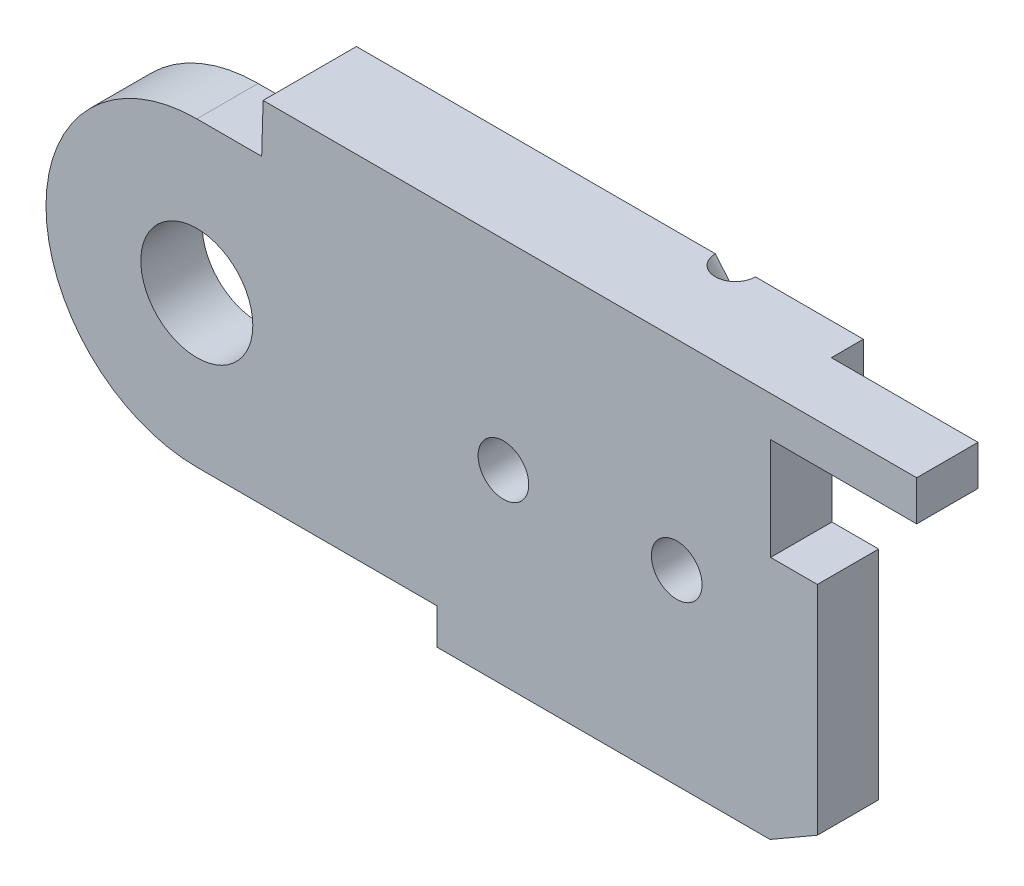
ISO-10303-21;
HEADER;
FILE_DESCRIPTION(('STEP AP214'),'2;1');
FILE_NAME('part.step','',(''),(''),'','','');
FILE_SCHEMA(('AUTOMOTIVE_DESIGN { 1 0 10303 214 1 1 1 1 }'));
ENDSEC;
DATA;
#1=APPLICATION_CONTEXT('core data for automotive mechanical design processes');
#2=APPLICATION_PROTOCOL_DEFINITION('international standard','automotive_design',2000,#1);
#3=PRODUCT_CONTEXT('',#1,'mechanical');
#4=PRODUCT('Part','Part','',(#3));
#5=PRODUCT_RELATED_PRODUCT_CATEGORY('part','',(#4));
#6=PRODUCT_DEFINITION_FORMATION('','',#4);
#7=PRODUCT_DEFINITION_CONTEXT('part definition',#1,'design');
#8=PRODUCT_DEFINITION('design','',#6,#7);
#9=PRODUCT_DEFINITION_SHAPE('','',#8);
#10=(LENGTH_UNIT() NAMED_UNIT(*) SI_UNIT(.MILLI.,.METRE.));
#11=(NAMED_UNIT(*) PLANE_ANGLE_UNIT() SI_UNIT($,.RADIAN.));
#12=(NAMED_UNIT(*) SI_UNIT($,.STERADIAN.) SOLID_ANGLE_UNIT());
#13=UNCERTAINTY_MEASURE_WITH_UNIT(LENGTH_MEASURE(1.E-05),#10,'distance_accuracy_value','');
#14=(GEOMETRIC_REPRESENTATION_CONTEXT(3) GLOBAL_UNCERTAINTY_ASSIGNED_CONTEXT((#13)) GLOBAL_UNIT_ASSIGNED_CONTEXT((#10,
#11,#12)) REPRESENTATION_CONTEXT('',''));
#15=CARTESIAN_POINT('',(0.,0.,0.));
#16=DIRECTION('',(0.,0.,1.));
#17=DIRECTION('',(1.,0.,0.));
#18=AXIS2_PLACEMENT_3D('',#15,#16,#17);
#19=CARTESIAN_POINT('',(0.,0.,11.5));
#20=DIRECTION('',(0.,0.,-1.));
#21=DIRECTION('',(1.,0.,0.));
#22=AXIS2_PLACEMENT_3D('',#19,#20,#21);
#23=CYLINDRICAL_SURFACE('',#22,2.1);
#24=CARTESIAN_POINT('',(0.,0.,11.5));
#25=DIRECTION('',(0.,0.,1.));
#26=DIRECTION('',(1.,0.,0.));
#27=AXIS2_PLACEMENT_3D('',#24,#25,#26);
#28=CIRCLE('',#27,2.1);
#29=CARTESIAN_POINT('',(2.1,0.,11.5));
#30=VERTEX_POINT('',#29);
#31=EDGE_CURVE('E230',#30,#30,#28,.T.);
#32=ORIENTED_EDGE('',*,*,#31,.T.);
#33=EDGE_LOOP('',(#32));
#34=FACE_BOUND('',#33,.T.);
#35=CARTESIAN_POINT('',(0.,0.,9.2));
#36=DIRECTION('',(0.,0.,1.));
#37=DIRECTION('',(1.,0.,0.));
#38=AXIS2_PLACEMENT_3D('',#35,#36,#37);
#39=CIRCLE('',#38,2.1);
#40=CARTESIAN_POINT('',(2.1,0.,9.2));
#41=VERTEX_POINT('',#40);
#42=EDGE_CURVE('E229',#41,#41,#39,.T.);
#43=ORIENTED_EDGE('',*,*,#42,.F.);
#44=EDGE_LOOP('',(#43));
#45=FACE_BOUND('',#44,.T.);
#46=ADVANCED_FACE('F42',(#34,#45),#23,.F.);
#47=CARTESIAN_POINT('',(21.5203540034992,2.1720062451962,11.6));
#48=DIRECTION('',(-1.,0.,0.));
#49=DIRECTION('',(0.,0.,-1.));
#50=AXIS2_PLACEMENT_3D('',#47,#48,#49);
#51=PLANE('',#50);
#52=DIRECTION('',(0.,0.,-1.));
#53=VECTOR('',#52,1.);
#54=CARTESIAN_POINT('',(21.5203540034992,6.,11.6));
#55=LINE('',#54,#53);
#56=CARTESIAN_POINT('',(21.5203540034992,6.,11.5));
#57=VERTEX_POINT('',#56);
#58=CARTESIAN_POINT('',(21.5203540034992,6.,9.2));
#59=VERTEX_POINT('',#58);
#60=EDGE_CURVE('E65',#57,#59,#55,.T.);
#61=ORIENTED_EDGE('',*,*,#60,.F.);
#62=DIRECTION('',(0.,-1.,0.));
#63=VECTOR('',#62,1.);
#64=CARTESIAN_POINT('',(21.5203540034992,0.,11.5));
#65=LINE('',#64,#63);
#66=CARTESIAN_POINT('',(21.5203540034992,2.1720062451962,11.5));
#67=VERTEX_POINT('',#66);
#68=EDGE_CURVE('E346',#57,#67,#65,.T.);
#69=ORIENTED_EDGE('',*,*,#68,.T.);
#70=DIRECTION('',(0.,0.,-1.));
#71=VECTOR('',#70,1.);
#72=CARTESIAN_POINT('',(21.5203540034992,2.1720062451962,11.6));
#73=LINE('',#72,#71);
#74=CARTESIAN_POINT('',(21.5203540034992,2.1720062451962,9.2));
#75=VERTEX_POINT('',#74);
#76=EDGE_CURVE('E388',#67,#75,#73,.T.);
#77=ORIENTED_EDGE('',*,*,#76,.T.);
#78=DIRECTION('',(0.,-1.,0.));
#79=VECTOR('',#78,1.);
#80=CARTESIAN_POINT('',(21.5203540034992,2.1720062451962,9.2));
#81=LINE('',#80,#79);
#82=EDGE_CURVE('E404',#59,#75,#81,.T.);
#83=ORIENTED_EDGE('',*,*,#82,.F.);
#84=EDGE_LOOP('',(#61,#69,#77,#83));
#85=FACE_BOUND('',#84,.T.);
#86=ADVANCED_FACE('F508',(#85),#51,.F.);
#87=CARTESIAN_POINT('',(27.,6.,11.6));
#88=DIRECTION('',(0.,1.,0.));
#89=DIRECTION('',(0.,0.,-1.));
#90=AXIS2_PLACEMENT_3D('',#87,#88,#89);
#91=PLANE('',#90);
#92=DIRECTION('',(0.,0.,-1.));
#93=VECTOR('',#92,1.);
#94=CARTESIAN_POINT('',(27.,6.,11.6));
#95=LINE('',#94,#93);
#96=CARTESIAN_POINT('',(27.,6.,11.5));
#97=VERTEX_POINT('',#96);
#98=CARTESIAN_POINT('',(27.,6.,9.2));
#99=VERTEX_POINT('',#98);
#100=EDGE_CURVE('E401',#97,#99,#95,.T.);
#101=ORIENTED_EDGE('',*,*,#100,.F.);
#102=DIRECTION('',(-1.,0.,0.));
#103=VECTOR('',#102,1.);
#104=CARTESIAN_POINT('',(0.,6.,11.5));
#105=LINE('',#104,#103);
#106=EDGE_CURVE('E343',#97,#57,#105,.T.);
#107=ORIENTED_EDGE('',*,*,#106,.T.);
#108=ORIENTED_EDGE('',*,*,#60,.T.);
#109=DIRECTION('',(-1.,0.,0.));
#110=VECTOR('',#109,1.);
#111=CARTESIAN_POINT('',(27.,6.,9.2));
#112=LINE('',#111,#110);
#113=EDGE_CURVE('E412',#99,#59,#112,.T.);
#114=ORIENTED_EDGE('',*,*,#113,.F.);
#115=EDGE_LOOP('',(#101,#107,#108,#114));
#116=FACE_BOUND('',#115,.T.);
#117=ADVANCED_FACE('F514',(#116),#91,.F.);
#118=CARTESIAN_POINT('',(0.,0.,9.2));
#119=DIRECTION('',(0.,0.,1.));
#120=DIRECTION('',(-1.,0.,0.));
#121=AXIS2_PLACEMENT_3D('',#118,#119,#120);
#122=CYLINDRICAL_SURFACE('',#121,5.65685424949238);
#123=CARTESIAN_POINT('',(0.,0.,11.5));
#124=DIRECTION('',(0.,0.,1.));
#125=DIRECTION('',(1.,0.,0.));
#126=AXIS2_PLACEMENT_3D('',#123,#124,#125);
#127=CIRCLE('',#126,5.65685424949238);
#128=CARTESIAN_POINT('',(0.,5.65685424949238,11.5));
#129=VERTEX_POINT('',#128);
#130=CARTESIAN_POINT('',(0.,-5.65685424949238,11.5));
#131=VERTEX_POINT('',#130);
#132=EDGE_CURVE('E234',#129,#131,#127,.T.);
#133=ORIENTED_EDGE('',*,*,#132,.F.);
#134=DIRECTION('',(0.,0.,1.));
#135=VECTOR('',#134,1.);
#136=CARTESIAN_POINT('',(0.,5.65685424949238,9.2));
#137=LINE('',#136,#135);
#138=CARTESIAN_POINT('',(0.,5.65685424949238,9.2));
#139=VERTEX_POINT('',#138);
#140=EDGE_CURVE('E267',#139,#129,#137,.T.);
#141=ORIENTED_EDGE('',*,*,#140,.F.);
#142=CARTESIAN_POINT('',(0.,0.,9.2));
#143=DIRECTION('',(0.,0.,1.));
#144=DIRECTION('',(1.,0.,0.));
#145=AXIS2_PLACEMENT_3D('',#142,#143,#144);
#146=CIRCLE('',#145,5.65685424949238);
#147=CARTESIAN_POINT('',(0.,-5.65685424949238,9.2));
#148=VERTEX_POINT('',#147);
#149=EDGE_CURVE('E238',#139,#148,#146,.T.);
#150=ORIENTED_EDGE('',*,*,#149,.T.);
#151=DIRECTION('',(0.,0.,1.));
#152=VECTOR('',#151,1.);
#153=CARTESIAN_POINT('',(0.,-5.65685424949238,9.2));
#154=LINE('',#153,#152);
#155=EDGE_CURVE('E339',#148,#131,#154,.T.);
#156=ORIENTED_EDGE('',*,*,#155,.T.);
#157=EDGE_LOOP('',(#133,#141,#150,#156));
#158=FACE_BOUND('',#157,.T.);
#159=ADVANCED_FACE('F44',(#158),#122,.T.);
#160=CARTESIAN_POINT('',(23.2751262658471,-5.97487373415292,9.2));
#161=DIRECTION('',(-1.,0.,0.));
#162=DIRECTION('',(0.,0.,-1.));
#163=AXIS2_PLACEMENT_3D('',#160,#161,#162);
#164=PLANE('',#163);
#165=DIRECTION('',(0.,1.,0.));
#166=VECTOR('',#165,1.);
#167=CARTESIAN_POINT('',(23.2751262658471,-5.97487373415292,11.5));
#168=LINE('',#167,#166);
#169=CARTESIAN_POINT('',(23.2751262658471,-5.97487373415292,11.5));
#170=VERTEX_POINT('',#169);
#171=CARTESIAN_POINT('',(23.2751262658471,2.1720062451962,11.5));
#172=VERTEX_POINT('',#171);
#173=EDGE_CURVE('E287',#170,#172,#168,.T.);
#174=ORIENTED_EDGE('',*,*,#173,.F.);
#175=DIRECTION('',(0.,0.,1.));
#176=VECTOR('',#175,1.);
#177=CARTESIAN_POINT('',(23.2751262658471,-5.97487373415292,9.2));
#178=LINE('',#177,#176);
#179=CARTESIAN_POINT('',(23.2751262658471,-5.97487373415292,9.2));
#180=VERTEX_POINT('',#179);
#181=EDGE_CURVE('E323',#180,#170,#178,.T.);
#182=ORIENTED_EDGE('',*,*,#181,.F.);
#183=DIRECTION('',(0.,1.,0.));
#184=VECTOR('',#183,1.);
#185=CARTESIAN_POINT('',(23.2751262658471,-5.97487373415292,9.2));
#186=LINE('',#185,#184);
#187=CARTESIAN_POINT('',(23.2751262658471,2.1720062451962,9.2));
#188=VERTEX_POINT('',#187);
#189=EDGE_CURVE('E251',#180,#188,#186,.T.);
#190=ORIENTED_EDGE('',*,*,#189,.T.);
#191=DIRECTION('',(0.,0.,1.));
#192=VECTOR('',#191,1.);
#193=CARTESIAN_POINT('',(23.2751262658471,2.1720062451962,9.2));
#194=LINE('',#193,#192);
#195=EDGE_CURVE('E319',#188,#172,#194,.T.);
#196=ORIENTED_EDGE('',*,*,#195,.T.);
#197=EDGE_LOOP('',(#174,#182,#190,#196));
#198=FACE_BOUND('',#197,.T.);
#199=ADVANCED_FACE('F471',(#198),#164,.F.);
#200=CARTESIAN_POINT('',(27.,2.1720062451962,11.6));
#201=DIRECTION('',(0.,-1.,0.));
#202=DIRECTION('',(0.,0.,1.));
#203=AXIS2_PLACEMENT_3D('',#200,#201,#202);
#204=PLANE('',#203);
#205=DIRECTION('',(1.,0.,0.));
#206=VECTOR('',#205,1.);
#207=CARTESIAN_POINT('',(0.,2.1720062451962,11.5));
#208=LINE('',#207,#206);
#209=EDGE_CURVE('E349',#67,#172,#208,.T.);
#210=ORIENTED_EDGE('',*,*,#209,.T.);
#211=ORIENTED_EDGE('',*,*,#195,.F.);
#212=DIRECTION('',(1.,0.,0.));
#213=VECTOR('',#212,1.);
#214=CARTESIAN_POINT('',(27.,2.1720062451962,9.2));
#215=LINE('',#214,#213);
#216=EDGE_CURVE('E416',#75,#188,#215,.T.);
#217=ORIENTED_EDGE('',*,*,#216,.F.);
#218=ORIENTED_EDGE('',*,*,#76,.F.);
#219=EDGE_LOOP('',(#210,#211,#217,#218));
#220=FACE_BOUND('',#219,.T.);
#221=ADVANCED_FACE('F474',(#220),#204,.F.);
#222=CARTESIAN_POINT('',(21.5,-6.99999999999999,9.2));
#223=DIRECTION('',(-0.500093895229063,0.865971186561437,0.));
#224=DIRECTION('',(-0.865971186561437,-0.500093895229063,0.));
#225=AXIS2_PLACEMENT_3D('',#222,#223,#224);
#226=PLANE('',#225);
#227=DIRECTION('',(0.865971186561437,0.500093895229063,0.));
#228=VECTOR('',#227,1.);
#229=CARTESIAN_POINT('',(21.5,-6.99999999999999,11.5));
#230=LINE('',#229,#228);
#231=CARTESIAN_POINT('',(21.5,-6.99999999999999,11.5));
#232=VERTEX_POINT('',#231);
#233=EDGE_CURVE('E283',#232,#170,#230,.T.);
#234=ORIENTED_EDGE('',*,*,#233,.F.);
#235=DIRECTION('',(0.,0.,1.));
#236=VECTOR('',#235,1.);
#237=CARTESIAN_POINT('',(21.5,-6.99999999999999,9.2));
#238=LINE('',#237,#236);
#239=CARTESIAN_POINT('',(21.5,-6.99999999999999,9.2));
#240=VERTEX_POINT('',#239);
#241=EDGE_CURVE('E327',#240,#232,#238,.T.);
#242=ORIENTED_EDGE('',*,*,#241,.F.);
#243=DIRECTION('',(0.865971186561437,0.500093895229063,0.));
#244=VECTOR('',#243,1.);
#245=CARTESIAN_POINT('',(21.5,-6.99999999999999,9.2));
#246=LINE('',#245,#244);
#247=EDGE_CURVE('E247',#240,#180,#246,.T.);
#248=ORIENTED_EDGE('',*,*,#247,.T.);
#249=ORIENTED_EDGE('',*,*,#181,.T.);
#250=EDGE_LOOP('',(#234,#242,#248,#249));
#251=FACE_BOUND('',#250,.T.);
#252=ADVANCED_FACE('F476',(#251),#226,.F.);
#253=CARTESIAN_POINT('',(21.5,-6.99999999999999,8.));
#254=DIRECTION('',(-1.,0.,0.));
#255=DIRECTION('',(0.,0.,-1.));
#256=AXIS2_PLACEMENT_3D('',#253,#254,#255);
#257=PLANE('',#256);
#258=DIRECTION('',(0.,1.,0.));
#259=VECTOR('',#258,1.);
#260=CARTESIAN_POINT('',(21.5,-6.99999999999999,9.2));
#261=LINE('',#260,#259);
#262=CARTESIAN_POINT('',(21.5,-5.65685424949238,9.2));
#263=VERTEX_POINT('',#262);
#264=EDGE_CURVE('E379',#240,#263,#261,.T.);
#265=ORIENTED_EDGE('',*,*,#264,.F.);
#266=DIRECTION('',(0.,0.,1.));
#267=VECTOR('',#266,1.);
#268=CARTESIAN_POINT('',(21.5,-6.99999999999999,8.));
#269=LINE('',#268,#267);
#270=CARTESIAN_POINT('',(21.5,-6.99999999999999,8.));
#271=VERTEX_POINT('',#270);
#272=EDGE_CURVE('E371',#271,#240,#269,.T.);
#273=ORIENTED_EDGE('',*,*,#272,.F.);
#274=DIRECTION('',(0.,1.,0.));
#275=VECTOR('',#274,1.);
#276=CARTESIAN_POINT('',(21.5,-6.99999999999999,8.));
#277=LINE('',#276,#275);
#278=CARTESIAN_POINT('',(21.5,-5.65685424949238,8.));
#279=VERTEX_POINT('',#278);
#280=EDGE_CURVE('E378',#271,#279,#277,.T.);
#281=ORIENTED_EDGE('',*,*,#280,.T.);
#282=DIRECTION('',(0.,0.,1.));
#283=VECTOR('',#282,1.);
#284=CARTESIAN_POINT('',(21.5,-5.65685424949238,8.));
#285=LINE('',#284,#283);
#286=EDGE_CURVE('E375',#279,#263,#285,.T.);
#287=ORIENTED_EDGE('',*,*,#286,.T.);
#288=EDGE_LOOP('',(#265,#273,#281,#287));
#289=FACE_BOUND('',#288,.T.);
#290=ADVANCED_FACE('F479',(#289),#257,.F.);
#291=CARTESIAN_POINT('',(9.,-6.99999999999999,9.2));
#292=DIRECTION('',(0.,1.,0.));
#293=DIRECTION('',(-1.,0.,0.));
#294=AXIS2_PLACEMENT_3D('',#291,#292,#293);
#295=PLANE('',#294);
#296=DIRECTION('',(1.,0.,0.));
#297=VECTOR('',#296,1.);
#298=CARTESIAN_POINT('',(9.,-6.99999999999999,11.5));
#299=LINE('',#298,#297);
#300=CARTESIAN_POINT('',(9.,-6.99999999999999,11.5));
#301=VERTEX_POINT('',#300);
#302=EDGE_CURVE('E279',#301,#232,#299,.T.);
#303=ORIENTED_EDGE('',*,*,#302,.F.);
#304=DIRECTION('',(0.,0.,1.));
#305=VECTOR('',#304,1.);
#306=CARTESIAN_POINT('',(9.,-6.99999999999999,9.2));
#307=LINE('',#306,#305);
#308=CARTESIAN_POINT('',(9.,-6.99999999999999,8.));
#309=VERTEX_POINT('',#308);
#310=EDGE_CURVE('E331',#309,#301,#307,.T.);
#311=ORIENTED_EDGE('',*,*,#310,.F.);
#312=DIRECTION('',(1.,0.,0.));
#313=VECTOR('',#312,1.);
#314=CARTESIAN_POINT('',(9.,-6.99999999999999,8.));
#315=LINE('',#314,#313);
#316=EDGE_CURVE('E391',#309,#271,#315,.T.);
#317=ORIENTED_EDGE('',*,*,#316,.T.);
#318=ORIENTED_EDGE('',*,*,#272,.T.);
#319=ORIENTED_EDGE('',*,*,#241,.T.);
#320=EDGE_LOOP('',(#303,#311,#317,#318,#319));
#321=FACE_BOUND('',#320,.T.);
#322=ADVANCED_FACE('F481',(#321),#295,.F.);
#323=CARTESIAN_POINT('',(21.5,-5.65685424949238,8.));
#324=DIRECTION('',(0.,-1.,0.));
#325=DIRECTION('',(0.,0.,1.));
#326=AXIS2_PLACEMENT_3D('',#323,#324,#325);
#327=PLANE('',#326);
#328=DIRECTION('',(-1.,0.,0.));
#329=VECTOR('',#328,1.);
#330=CARTESIAN_POINT('',(21.5,-5.65685424949238,9.2));
#331=LINE('',#330,#329);
#332=CARTESIAN_POINT('',(9.,-5.65685424949238,9.2));
#333=VERTEX_POINT('',#332);
#334=EDGE_CURVE('E384',#263,#333,#331,.T.);
#335=ORIENTED_EDGE('',*,*,#334,.F.);
#336=ORIENTED_EDGE('',*,*,#286,.F.);
#337=DIRECTION('',(-1.,0.,0.));
#338=VECTOR('',#337,1.);
#339=CARTESIAN_POINT('',(21.5,-5.65685424949238,8.));
#340=LINE('',#339,#338);
#341=CARTESIAN_POINT('',(9.,-5.65685424949238,8.));
#342=VERTEX_POINT('',#341);
#343=EDGE_CURVE('E383',#279,#342,#340,.T.);
#344=ORIENTED_EDGE('',*,*,#343,.T.);
#345=DIRECTION('',(0.,0.,1.));
#346=VECTOR('',#345,1.);
#347=CARTESIAN_POINT('',(9.,-5.65685424949238,8.));
#348=LINE('',#347,#346);
#349=EDGE_CURVE('E218',#342,#333,#348,.T.);
#350=ORIENTED_EDGE('',*,*,#349,.T.);
#351=EDGE_LOOP('',(#335,#336,#344,#350));
#352=FACE_BOUND('',#351,.T.);
#353=ADVANCED_FACE('F484',(#352),#327,.F.);
#354=CARTESIAN_POINT('',(9.,-5.65685424949238,9.2));
#355=DIRECTION('',(0.,1.,0.));
#356=DIRECTION('',(0.,0.,-1.));
#357=AXIS2_PLACEMENT_3D('',#354,#355,#356);
#358=PLANE('',#357);
#359=DIRECTION('',(1.,0.,0.));
#360=VECTOR('',#359,1.);
#361=CARTESIAN_POINT('',(9.,-5.65685424949238,11.5));
#362=LINE('',#361,#360);
#363=CARTESIAN_POINT('',(9.,-5.65685424949238,11.5));
#364=VERTEX_POINT('',#363);
#365=EDGE_CURVE('E271',#131,#364,#362,.T.);
#366=ORIENTED_EDGE('',*,*,#365,.F.);
#367=ORIENTED_EDGE('',*,*,#155,.F.);
#368=DIRECTION('',(1.,0.,0.));
#369=VECTOR('',#368,1.);
#370=CARTESIAN_POINT('',(9.,-5.65685424949238,9.2));
#371=LINE('',#370,#369);
#372=EDGE_CURVE('E242',#148,#333,#371,.T.);
#373=ORIENTED_EDGE('',*,*,#372,.T.);
#374=DIRECTION('',(0.,0.,1.));
#375=VECTOR('',#374,1.);
#376=CARTESIAN_POINT('',(9.,-5.65685424949238,9.2));
#377=LINE('',#376,#375);
#378=EDGE_CURVE('E335',#333,#364,#377,.T.);
#379=ORIENTED_EDGE('',*,*,#378,.T.);
#380=EDGE_LOOP('',(#366,#367,#373,#379));
#381=FACE_BOUND('',#380,.T.);
#382=ADVANCED_FACE('F490',(#381),#358,.F.);
#383=CARTESIAN_POINT('',(2.4326880657739,5.65685424949238,9.2));
#384=DIRECTION('',(0.,-1.,0.));
#385=DIRECTION('',(0.,0.,1.));
#386=AXIS2_PLACEMENT_3D('',#383,#384,#385);
#387=PLANE('',#386);
#388=DIRECTION('',(-1.,0.,0.));
#389=VECTOR('',#388,1.);
#390=CARTESIAN_POINT('',(2.4326880657739,5.65685424949238,11.5));
#391=LINE('',#390,#389);
#392=CARTESIAN_POINT('',(2.4326880657739,5.65685424949238,11.5));
#393=VERTEX_POINT('',#392);
#394=EDGE_CURVE('E243',#393,#129,#391,.T.);
#395=ORIENTED_EDGE('',*,*,#394,.F.);
#396=DIRECTION('',(0.,0.,1.));
#397=VECTOR('',#396,1.);
#398=CARTESIAN_POINT('',(2.4326880657739,5.65685424949238,9.2));
#399=LINE('',#398,#397);
#400=CARTESIAN_POINT('',(2.4326880657739,5.65685424949238,9.2));
#401=VERTEX_POINT('',#400);
#402=EDGE_CURVE('E308',#401,#393,#399,.T.);
#403=ORIENTED_EDGE('',*,*,#402,.F.);
#404=DIRECTION('',(-1.,0.,0.));
#405=VECTOR('',#404,1.);
#406=CARTESIAN_POINT('',(2.4326880657739,5.65685424949238,9.2));
#407=LINE('',#406,#405);
#408=EDGE_CURVE('E263',#401,#139,#407,.T.);
#409=ORIENTED_EDGE('',*,*,#408,.T.);
#410=ORIENTED_EDGE('',*,*,#140,.T.);
#411=EDGE_LOOP('',(#395,#403,#409,#410));
#412=FACE_BOUND('',#411,.T.);
#413=ADVANCED_FACE('F469',(#412),#387,.F.);
#414=CARTESIAN_POINT('',(27.,7.5,9.2));
#415=DIRECTION('',(-1.,0.,0.));
#416=DIRECTION('',(0.,0.,-1.));
#417=AXIS2_PLACEMENT_3D('',#414,#415,#416);
#418=PLANE('',#417);
#419=DIRECTION('',(0.,1.,0.));
#420=VECTOR('',#419,1.);
#421=CARTESIAN_POINT('',(27.,7.5,9.2));
#422=LINE('',#421,#420);
#423=CARTESIAN_POINT('',(27.,7.5,9.2));
#424=VERTEX_POINT('',#423);
#425=EDGE_CURVE('E255',#99,#424,#422,.T.);
#426=ORIENTED_EDGE('',*,*,#425,.T.);
#427=DIRECTION('',(0.,0.,1.));
#428=VECTOR('',#427,1.);
#429=CARTESIAN_POINT('',(27.,7.5,9.2));
#430=LINE('',#429,#428);
#431=CARTESIAN_POINT('',(27.,7.5,11.5));
#432=VERTEX_POINT('',#431);
#433=EDGE_CURVE('E315',#424,#432,#430,.T.);
#434=ORIENTED_EDGE('',*,*,#433,.T.);
#435=DIRECTION('',(0.,1.,0.));
#436=VECTOR('',#435,1.);
#437=CARTESIAN_POINT('',(27.,7.5,11.5));
#438=LINE('',#437,#436);
#439=EDGE_CURVE('E291',#97,#432,#438,.T.);
#440=ORIENTED_EDGE('',*,*,#439,.F.);
#441=ORIENTED_EDGE('',*,*,#100,.T.);
#442=EDGE_LOOP('',(#426,#434,#440,#441));
#443=FACE_BOUND('',#442,.T.);
#444=ADVANCED_FACE('F465',(#443),#418,.F.);
#445=CARTESIAN_POINT('',(0.,0.,11.5));
#446=DIRECTION('',(0.,0.,-1.));
#447=DIRECTION('',(1.,0.,0.));
#448=AXIS2_PLACEMENT_3D('',#445,#446,#447);
#449=PLANE('',#448);
#450=CARTESIAN_POINT('',(11.5,0.,11.5));
#451=DIRECTION('',(0.,0.,1.));
#452=DIRECTION('',(1.,0.,0.));
#453=AXIS2_PLACEMENT_3D('',#450,#451,#452);
#454=CIRCLE('',#453,0.949999999999999);
#455=CARTESIAN_POINT('',(12.45,0.,11.5));
#456=VERTEX_POINT('',#455);
#457=EDGE_CURVE('E433',#456,#456,#454,.T.);
#458=ORIENTED_EDGE('',*,*,#457,.F.);
#459=EDGE_LOOP('',(#458));
#460=FACE_BOUND('',#459,.T.);
#461=CARTESIAN_POINT('',(18.,0.,11.5));
#462=DIRECTION('',(0.,0.,1.));
#463=DIRECTION('',(1.,0.,0.));
#464=AXIS2_PLACEMENT_3D('',#461,#462,#463);
#465=CIRCLE('',#464,0.950000000000001);
#466=CARTESIAN_POINT('',(18.95,0.,11.5));
#467=VERTEX_POINT('',#466);
#468=EDGE_CURVE('E440',#467,#467,#465,.T.);
#469=ORIENTED_EDGE('',*,*,#468,.F.);
#470=EDGE_LOOP('',(#469));
#471=FACE_BOUND('',#470,.T.);
#472=ORIENTED_EDGE('',*,*,#31,.F.);
#473=EDGE_LOOP('',(#472));
#474=FACE_BOUND('',#473,.T.);
#475=ORIENTED_EDGE('',*,*,#68,.F.);
#476=ORIENTED_EDGE('',*,*,#106,.F.);
#477=ORIENTED_EDGE('',*,*,#439,.T.);
#478=DIRECTION('',(-1.,0.,0.));
#479=VECTOR('',#478,1.);
#480=CARTESIAN_POINT('',(27.,7.5,11.5));
#481=LINE('',#480,#479);
#482=CARTESIAN_POINT('',(2.48679014755027,7.5,11.5));
#483=VERTEX_POINT('',#482);
#484=EDGE_CURVE('E295',#432,#483,#481,.T.);
#485=ORIENTED_EDGE('',*,*,#484,.T.);
#486=DIRECTION('',(-0.0293404845923219,-0.999569475306188,0.));
#487=VECTOR('',#486,1.);
#488=CARTESIAN_POINT('',(2.4326880657739,5.65685424949238,11.5));
#489=LINE('',#488,#487);
#490=EDGE_CURVE('E299',#483,#393,#489,.T.);
#491=ORIENTED_EDGE('',*,*,#490,.T.);
#492=ORIENTED_EDGE('',*,*,#394,.T.);
#493=ORIENTED_EDGE('',*,*,#132,.T.);
#494=ORIENTED_EDGE('',*,*,#365,.T.);
#495=DIRECTION('',(0.,-1.,0.));
#496=VECTOR('',#495,1.);
#497=CARTESIAN_POINT('',(9.,-6.99999999999999,11.5));
#498=LINE('',#497,#496);
#499=EDGE_CURVE('E275',#364,#301,#498,.T.);
#500=ORIENTED_EDGE('',*,*,#499,.T.);
#501=ORIENTED_EDGE('',*,*,#302,.T.);
#502=ORIENTED_EDGE('',*,*,#233,.T.);
#503=ORIENTED_EDGE('',*,*,#173,.T.);
#504=ORIENTED_EDGE('',*,*,#209,.F.);
#505=EDGE_LOOP('',(#475,#476,#477,#485,#491,#492,#493,#494,#500,#501,#502,#503,#504));
#506=FACE_BOUND('',#505,.T.);
#507=ADVANCED_FACE('F468',(#460,#471,#474,#506),#449,.F.);
#508=CARTESIAN_POINT('',(2.4326880657739,5.65685424949238,9.2));
#509=DIRECTION('',(0.999569475306188,-0.0293404845923219,0.));
#510=DIRECTION('',(0.0293404845923219,0.999569475306188,0.));
#511=AXIS2_PLACEMENT_3D('',#508,#509,#510);
#512=PLANE('',#511);
#513=ORIENTED_EDGE('',*,*,#490,.F.);
#514=DIRECTION('',(0.,0.,1.));
#515=VECTOR('',#514,1.);
#516=CARTESIAN_POINT('',(2.48679014755027,7.5,9.2));
#517=LINE('',#516,#515);
#518=CARTESIAN_POINT('',(2.48679014755027,7.5,8.));
#519=VERTEX_POINT('',#518);
#520=EDGE_CURVE('E312',#519,#483,#517,.T.);
#521=ORIENTED_EDGE('',*,*,#520,.F.);
#522=DIRECTION('',(-0.0293404845923219,-0.999569475306188,0.));
#523=VECTOR('',#522,1.);
#524=CARTESIAN_POINT('',(2.48679014755027,7.5,8.));
#525=LINE('',#524,#523);
#526=CARTESIAN_POINT('',(2.4326880657739,5.65685424949238,8.));
#527=VERTEX_POINT('',#526);
#528=EDGE_CURVE('E201',#519,#527,#525,.T.);
#529=ORIENTED_EDGE('',*,*,#528,.T.);
#530=DIRECTION('',(0.,0.,1.));
#531=VECTOR('',#530,1.);
#532=CARTESIAN_POINT('',(2.4326880657739,5.65685424949238,8.));
#533=LINE('',#532,#531);
#534=EDGE_CURVE('E189',#527,#401,#533,.T.);
#535=ORIENTED_EDGE('',*,*,#534,.T.);
#536=ORIENTED_EDGE('',*,*,#402,.T.);
#537=EDGE_LOOP('',(#513,#521,#529,#535,#536));
#538=FACE_BOUND('',#537,.T.);
#539=ADVANCED_FACE('F463',(#538),#512,.F.);
#540=CARTESIAN_POINT('',(0.,0.,9.2));
#541=DIRECTION('',(0.,0.,-1.));
#542=DIRECTION('',(1.,0.,0.));
#543=AXIS2_PLACEMENT_3D('',#540,#541,#542);
#544=PLANE('',#543);
#545=CARTESIAN_POINT('',(18.,0.,9.2));
#546=DIRECTION('',(0.,0.,1.));
#547=DIRECTION('',(1.,0.,0.));
#548=AXIS2_PLACEMENT_3D('',#545,#546,#547);
#549=CIRCLE('',#548,2.5);
#550=CARTESIAN_POINT('',(20.5,0.,9.2));
#551=VERTEX_POINT('',#550);
#552=EDGE_CURVE('E429',#551,#551,#549,.T.);
#553=ORIENTED_EDGE('',*,*,#552,.T.);
#554=EDGE_LOOP('',(#553));
#555=FACE_BOUND('',#554,.T.);
#556=CARTESIAN_POINT('',(11.5,0.,9.2));
#557=DIRECTION('',(0.,0.,1.));
#558=DIRECTION('',(1.,0.,0.));
#559=AXIS2_PLACEMENT_3D('',#556,#557,#558);
#560=CIRCLE('',#559,2.5);
#561=CARTESIAN_POINT('',(14.,0.,9.2));
#562=VERTEX_POINT('',#561);
#563=EDGE_CURVE('E421',#562,#562,#560,.T.);
#564=ORIENTED_EDGE('',*,*,#563,.T.);
#565=EDGE_LOOP('',(#564));
#566=FACE_BOUND('',#565,.T.);
#567=ORIENTED_EDGE('',*,*,#216,.T.);
#568=ORIENTED_EDGE('',*,*,#189,.F.);
#569=ORIENTED_EDGE('',*,*,#247,.F.);
#570=ORIENTED_EDGE('',*,*,#264,.T.);
#571=ORIENTED_EDGE('',*,*,#334,.T.);
#572=ORIENTED_EDGE('',*,*,#372,.F.);
#573=ORIENTED_EDGE('',*,*,#149,.F.);
#574=ORIENTED_EDGE('',*,*,#408,.F.);
#575=DIRECTION('',(1.,0.,0.));
#576=VECTOR('',#575,1.);
#577=CARTESIAN_POINT('',(2.4326880657739,5.65685424949238,9.2));
#578=LINE('',#577,#576);
#579=CARTESIAN_POINT('',(21.5,5.65685424949238,9.2));
#580=VERTEX_POINT('',#579);
#581=EDGE_CURVE('E213',#401,#580,#578,.T.);
#582=ORIENTED_EDGE('',*,*,#581,.T.);
#583=DIRECTION('',(0.,1.,0.));
#584=VECTOR('',#583,1.);
#585=CARTESIAN_POINT('',(21.5,5.65685424949238,9.2));
#586=LINE('',#585,#584);
#587=CARTESIAN_POINT('',(21.5,7.5,9.2));
#588=VERTEX_POINT('',#587);
#589=EDGE_CURVE('E217',#580,#588,#586,.T.);
#590=ORIENTED_EDGE('',*,*,#589,.T.);
#591=DIRECTION('',(-1.,0.,0.));
#592=VECTOR('',#591,1.);
#593=CARTESIAN_POINT('',(27.,7.5,9.2));
#594=LINE('',#593,#592);
#595=EDGE_CURVE('E259',#424,#588,#594,.T.);
#596=ORIENTED_EDGE('',*,*,#595,.F.);
#597=ORIENTED_EDGE('',*,*,#425,.F.);
#598=ORIENTED_EDGE('',*,*,#113,.T.);
#599=ORIENTED_EDGE('',*,*,#82,.T.);
#600=EDGE_LOOP('',(#567,#568,#569,#570,#571,#572,#573,#574,#582,#590,#596,#597,#598,#599));
#601=FACE_BOUND('',#600,.T.);
#602=ORIENTED_EDGE('',*,*,#42,.T.);
#603=EDGE_LOOP('',(#602));
#604=FACE_BOUND('',#603,.T.);
#605=ADVANCED_FACE('F519',(#555,#566,#601,#604),#544,.T.);
#606=CARTESIAN_POINT('',(21.5,5.65685424949238,8.));
#607=DIRECTION('',(-1.,0.,0.));
#608=DIRECTION('',(0.,0.,-1.));
#609=AXIS2_PLACEMENT_3D('',#606,#607,#608);
#610=PLANE('',#609);
#611=ORIENTED_EDGE('',*,*,#589,.F.);
#612=DIRECTION('',(0.,0.,1.));
#613=VECTOR('',#612,1.);
#614=CARTESIAN_POINT('',(21.5,5.65685424949238,8.));
#615=LINE('',#614,#613);
#616=CARTESIAN_POINT('',(21.5,5.65685424949238,8.));
#617=VERTEX_POINT('',#616);
#618=EDGE_CURVE('E224',#617,#580,#615,.T.);
#619=ORIENTED_EDGE('',*,*,#618,.F.);
#620=DIRECTION('',(0.,1.,0.));
#621=VECTOR('',#620,1.);
#622=CARTESIAN_POINT('',(21.5,5.65685424949238,8.));
#623=LINE('',#622,#621);
#624=CARTESIAN_POINT('',(21.5,7.5,8.));
#625=VERTEX_POINT('',#624);
#626=EDGE_CURVE('E194',#617,#625,#623,.T.);
#627=ORIENTED_EDGE('',*,*,#626,.T.);
#628=DIRECTION('',(0.,0.,1.));
#629=VECTOR('',#628,1.);
#630=CARTESIAN_POINT('',(21.5,7.5,8.));
#631=LINE('',#630,#629);
#632=EDGE_CURVE('E210',#625,#588,#631,.T.);
#633=ORIENTED_EDGE('',*,*,#632,.T.);
#634=EDGE_LOOP('',(#611,#619,#627,#633));
#635=FACE_BOUND('',#634,.T.);
#636=ADVANCED_FACE('F363',(#635),#610,.F.);
#637=CARTESIAN_POINT('',(2.4326880657739,5.65685424949238,8.));
#638=DIRECTION('',(0.,1.,0.));
#639=DIRECTION('',(0.,0.,-1.));
#640=AXIS2_PLACEMENT_3D('',#637,#638,#639);
#641=PLANE('',#640);
#642=DIRECTION('',(1.,0.,0.));
#643=VECTOR('',#642,1.);
#644=CARTESIAN_POINT('',(2.4326880657739,5.65685424949238,8.));
#645=LINE('',#644,#643);
#646=CARTESIAN_POINT('',(18.9854768194204,5.65685424949238,8.));
#647=VERTEX_POINT('',#646);
#648=EDGE_CURVE('E195',#647,#617,#645,.T.);
#649=ORIENTED_EDGE('',*,*,#648,.T.);
#650=ORIENTED_EDGE('',*,*,#618,.T.);
#651=ORIENTED_EDGE('',*,*,#581,.F.);
#652=ORIENTED_EDGE('',*,*,#534,.F.);
#653=CARTESIAN_POINT('',(17.4854768194204,5.65685424949238,8.));
#654=VERTEX_POINT('',#653);
#655=EDGE_CURVE('E185',#527,#654,#645,.T.);
#656=ORIENTED_EDGE('',*,*,#655,.T.);
#657=CARTESIAN_POINT('',(18.2354768194204,5.65685424949238,8.));
#658=DIRECTION('',(0.,1.,0.));
#659=DIRECTION('',(0.,0.,1.));
#660=AXIS2_PLACEMENT_3D('',#657,#658,#659);
#661=CIRCLE('',#660,0.750000000000002);
#662=EDGE_CURVE('E175',#654,#647,#661,.T.);
#663=ORIENTED_EDGE('',*,*,#662,.T.);
#664=EDGE_LOOP('',(#649,#650,#651,#652,#656,#663));
#665=FACE_BOUND('',#664,.T.);
#666=ADVANCED_FACE('F186',(#665),#641,.F.);
#667=CARTESIAN_POINT('',(27.,7.5,9.2));
#668=DIRECTION('',(0.,-1.,0.));
#669=DIRECTION('',(1.,0.,0.));
#670=AXIS2_PLACEMENT_3D('',#667,#668,#669);
#671=PLANE('',#670);
#672=DIRECTION('',(-1.,0.,0.));
#673=VECTOR('',#672,1.);
#674=CARTESIAN_POINT('',(2.48679014755027,7.5,8.));
#675=LINE('',#674,#673);
#676=CARTESIAN_POINT('',(15.9486037421156,7.5,8.));
#677=VERTEX_POINT('',#676);
#678=EDGE_CURVE('E200',#677,#519,#675,.T.);
#679=ORIENTED_EDGE('',*,*,#678,.T.);
#680=ORIENTED_EDGE('',*,*,#520,.T.);
#681=ORIENTED_EDGE('',*,*,#484,.F.);
#682=ORIENTED_EDGE('',*,*,#433,.F.);
#683=ORIENTED_EDGE('',*,*,#595,.T.);
#684=ORIENTED_EDGE('',*,*,#632,.F.);
#685=CARTESIAN_POINT('',(17.4486037421156,7.5,8.));
#686=VERTEX_POINT('',#685);
#687=EDGE_CURVE('E205',#625,#686,#675,.T.);
#688=ORIENTED_EDGE('',*,*,#687,.T.);
#689=CARTESIAN_POINT('',(15.9486037421156,7.5,8.));
#690=CARTESIAN_POINT('',(15.9485828223259,7.5,8.0370057819981));
#691=CARTESIAN_POINT('',(15.9513415433594,7.5,8.07400519117771));
#692=CARTESIAN_POINT('',(15.9622658553059,7.5,8.14719785154291));
#693=CARTESIAN_POINT('',(15.9704314462188,7.5,8.18339110272848));
#694=CARTESIAN_POINT('',(15.9921393934185,7.5,8.25457912342609));
#695=CARTESIAN_POINT('',(16.0057416320877,7.5,8.28955566344966));
#696=CARTESIAN_POINT('',(16.038007282868,7.5,8.35708944910952));
#697=CARTESIAN_POINT('',(16.0566711070594,7.5,8.38964649749203));
#698=CARTESIAN_POINT('',(16.1009739517883,7.5,8.45504389548479));
#699=CARTESIAN_POINT('',(16.1271556218163,7.5,8.48751855255512));
#700=CARTESIAN_POINT('',(16.1845300787262,7.5,8.54768309791566));
#701=CARTESIAN_POINT('',(16.215722865608,7.5,8.57537298620588));
#702=CARTESIAN_POINT('',(16.2822616845173,7.5,8.62520942028615));
#703=CARTESIAN_POINT('',(16.3176077165447,7.5,8.6473559660762));
#704=CARTESIAN_POINT('',(16.3914774729578,7.5,8.6854935031053));
#705=CARTESIAN_POINT('',(16.4300011973436,7.5,8.70148449434435));
#706=CARTESIAN_POINT('',(16.509163978992,7.5,8.72687023896869));
#707=CARTESIAN_POINT('',(16.5498030362547,7.5,8.73626499235399));
#708=CARTESIAN_POINT('',(16.632075555852,7.5,8.74819904163823));
#709=CARTESIAN_POINT('',(16.6737090181867,7.5,8.75073833753716));
#710=CARTESIAN_POINT('',(16.7568220529829,7.5,8.7488914629648));
#711=CARTESIAN_POINT('',(16.7983016254444,7.5,8.74450529249352));
#712=CARTESIAN_POINT('',(16.8799628150021,7.5,8.72892844791117));
#713=CARTESIAN_POINT('',(16.9201444320982,7.5,8.71773777380011));
#714=CARTESIAN_POINT('',(16.9981014450578,7.5,8.6888606028157));
#715=CARTESIAN_POINT('',(17.0358768409213,7.5,8.67117410594234));
#716=CARTESIAN_POINT('',(17.1079795264237,7.5,8.62979301329815));
#717=CARTESIAN_POINT('',(17.1423068160626,7.5,8.6060984175273));
#718=CARTESIAN_POINT('',(17.2065664512203,7.5,8.55335500429203));
#719=CARTESIAN_POINT('',(17.2364987967392,7.5,8.5243061868276));
#720=CARTESIAN_POINT('',(17.2911431356884,7.5,8.46165423749521));
#721=CARTESIAN_POINT('',(17.3158551291189,7.5,8.42805110562723));
#722=CARTESIAN_POINT('',(17.3593765510825,7.5,8.35722219362264));
#723=CARTESIAN_POINT('',(17.3781859796156,7.5,8.31999641348602));
#724=CARTESIAN_POINT('',(17.4093858052971,7.5,8.24293085658551));
#725=CARTESIAN_POINT('',(17.4217762024454,7.5,8.20309107982162));
#726=CARTESIAN_POINT('',(17.4366988841339,7.5,8.13587592337744));
#727=CARTESIAN_POINT('',(17.4411547413667,7.5,8.10891190482969));
#728=CARTESIAN_POINT('',(17.4471101011285,7.5,8.054636120109));
#729=CARTESIAN_POINT('',(17.4486070790076,7.5,8.02732407696351));
#730=CARTESIAN_POINT('',(17.4486037421156,7.5,8.00000000000001));
#731=B_SPLINE_CURVE_WITH_KNOTS('',3,(#689,#690,#691,#692,#693,#694,#695,#696,#697,#698,#699,
#700,#701,#702,#703,#704,#705,#706,#707,#708,#709,#710,#711,#712,#713,#714,#715,#716,#717,#718,
#719,#720,#721,#722,#723,#724,#725,#726,#727,#728,#729,#730),.UNSPECIFIED.,.F.,.F.,(4,2,2,2,2,2,
2,2,2,2,2,2,2,2,2,2,2,2,2,2,4),(0.,0.110905075743071,0.221810151486142,0.333972034634099,
0.446143051990056,0.570700323775496,0.695257595560365,0.819814867345232,0.944372139130096,
1.06892941091496,1.19348668269983,1.31804395448469,1.44260122626956,1.56715849805442,
1.69171576983929,1.81627304162415,1.94083031340901,2.06538758519388,2.18994485697874,
2.27178284385731,2.35369062852365),.UNSPECIFIED.);
#732=EDGE_CURVE('E182',#677,#686,#731,.T.);
#733=ORIENTED_EDGE('',*,*,#732,.F.);
#734=EDGE_LOOP('',(#679,#680,#681,#682,#683,#684,#688,#733));
#735=FACE_BOUND('',#734,.T.);
#736=ADVANCED_FACE('F359',(#735),#671,.F.);
#737=CARTESIAN_POINT('',(11.8313748573051,13.3371848451654,8.));
#738=DIRECTION('',(0.,1.,0.));
#739=DIRECTION('',(0.,0.,1.));
#740=AXIS2_PLACEMENT_3D('',#737,#738,#739);
#741=CIRCLE('',#740,0.750000000000002);
#742=DIRECTION('',(0.640410196211525,-0.768033059567306,0.));
#743=VECTOR('',#742,1.);
#744=SURFACE_OF_LINEAR_EXTRUSION('',#741,#743);
#745=DIRECTION('',(0.640410196211525,-0.768033059567306,0.));
#746=VECTOR('',#745,1.);
#747=CARTESIAN_POINT('',(11.0813748573051,13.3371848451654,8.));
#748=LINE('',#747,#746);
#749=EDGE_CURVE('E12',#677,#654,#748,.T.);
#750=ORIENTED_EDGE('',*,*,#749,.F.);
#751=ORIENTED_EDGE('',*,*,#732,.T.);
#752=DIRECTION('',(0.640410196211525,-0.768033059567306,0.));
#753=VECTOR('',#752,1.);
#754=CARTESIAN_POINT('',(12.5813748573051,13.3371848451654,8.));
#755=LINE('',#754,#753);
#756=EDGE_CURVE('E51',#647,#686,#755,.F.);
#757=ORIENTED_EDGE('',*,*,#756,.F.);
#758=ORIENTED_EDGE('',*,*,#662,.F.);
#759=EDGE_LOOP('',(#750,#751,#757,#758));
#760=FACE_BOUND('',#759,.T.);
#761=ADVANCED_FACE('F177',(#760),#744,.T.);
#762=CARTESIAN_POINT('',(18.,0.,8.));
#763=DIRECTION('',(0.,0.,1.));
#764=DIRECTION('',(-1.,0.,0.));
#765=AXIS2_PLACEMENT_3D('',#762,#763,#764);
#766=CYLINDRICAL_SURFACE('',#765,2.5);
#767=CARTESIAN_POINT('',(18.,0.,8.));
#768=DIRECTION('',(0.,0.,1.));
#769=DIRECTION('',(1.,0.,0.));
#770=AXIS2_PLACEMENT_3D('',#767,#768,#769);
#771=CIRCLE('',#770,2.5);
#772=CARTESIAN_POINT('',(20.5,0.,8.));
#773=VERTEX_POINT('',#772);
#774=EDGE_CURVE('E425',#773,#773,#771,.T.);
#775=ORIENTED_EDGE('',*,*,#774,.T.);
#776=EDGE_LOOP('',(#775));
#777=FACE_BOUND('',#776,.T.);
#778=ORIENTED_EDGE('',*,*,#552,.F.);
#779=EDGE_LOOP('',(#778));
#780=FACE_BOUND('',#779,.T.);
#781=ADVANCED_FACE('F629',(#777,#780),#766,.T.);
#782=CARTESIAN_POINT('',(18.,0.,16.));
#783=DIRECTION('',(0.,0.,-1.));
#784=DIRECTION('',(1.,0.,0.));
#785=AXIS2_PLACEMENT_3D('',#782,#783,#784);
#786=CYLINDRICAL_SURFACE('',#785,0.950000000000001);
#787=CARTESIAN_POINT('',(18.,0.,8.));
#788=DIRECTION('',(0.,0.,1.));
#789=DIRECTION('',(1.,0.,0.));
#790=AXIS2_PLACEMENT_3D('',#787,#788,#789);
#791=CIRCLE('',#790,0.950000000000001);
#792=CARTESIAN_POINT('',(18.95,0.,8.));
#793=VERTEX_POINT('',#792);
#794=EDGE_CURVE('E357',#793,#793,#791,.T.);
#795=ORIENTED_EDGE('',*,*,#794,.F.);
#796=EDGE_LOOP('',(#795));
#797=FACE_BOUND('',#796,.T.);
#798=ORIENTED_EDGE('',*,*,#468,.T.);
#799=EDGE_LOOP('',(#798));
#800=FACE_BOUND('',#799,.T.);
#801=ADVANCED_FACE('F638',(#797,#800),#786,.F.);
#802=CARTESIAN_POINT('',(11.5,0.,8.));
#803=DIRECTION('',(0.,0.,1.));
#804=DIRECTION('',(-1.,0.,0.));
#805=AXIS2_PLACEMENT_3D('',#802,#803,#804);
#806=CYLINDRICAL_SURFACE('',#805,2.5);
#807=CARTESIAN_POINT('',(11.5,0.,8.));
#808=DIRECTION('',(0.,0.,1.));
#809=DIRECTION('',(1.,0.,0.));
#810=AXIS2_PLACEMENT_3D('',#807,#808,#809);
#811=CIRCLE('',#810,2.5);
#812=CARTESIAN_POINT('',(14.,0.,8.));
#813=VERTEX_POINT('',#812);
#814=EDGE_CURVE('E420',#813,#813,#811,.T.);
#815=ORIENTED_EDGE('',*,*,#814,.T.);
#816=EDGE_LOOP('',(#815));
#817=FACE_BOUND('',#816,.T.);
#818=ORIENTED_EDGE('',*,*,#563,.F.);
#819=EDGE_LOOP('',(#818));
#820=FACE_BOUND('',#819,.T.);
#821=ADVANCED_FACE('F650',(#817,#820),#806,.T.);
#822=CARTESIAN_POINT('',(11.5,0.,16.));
#823=DIRECTION('',(0.,0.,-1.));
#824=DIRECTION('',(1.,0.,0.));
#825=AXIS2_PLACEMENT_3D('',#822,#823,#824);
#826=CYLINDRICAL_SURFACE('',#825,0.949999999999999);
#827=CARTESIAN_POINT('',(11.5,0.,8.));
#828=DIRECTION('',(0.,0.,1.));
#829=DIRECTION('',(1.,0.,0.));
#830=AXIS2_PLACEMENT_3D('',#827,#828,#829);
#831=CIRCLE('',#830,0.949999999999999);
#832=CARTESIAN_POINT('',(12.45,0.,8.));
#833=VERTEX_POINT('',#832);
#834=EDGE_CURVE('E444',#833,#833,#831,.T.);
#835=ORIENTED_EDGE('',*,*,#834,.F.);
#836=EDGE_LOOP('',(#835));
#837=FACE_BOUND('',#836,.T.);
#838=ORIENTED_EDGE('',*,*,#457,.T.);
#839=EDGE_LOOP('',(#838));
#840=FACE_BOUND('',#839,.T.);
#841=ADVANCED_FACE('F488',(#837,#840),#826,.F.);
#842=CARTESIAN_POINT('',(9.,-6.99999999999999,9.2));
#843=DIRECTION('',(1.,0.,0.));
#844=DIRECTION('',(0.,0.,1.));
#845=AXIS2_PLACEMENT_3D('',#842,#843,#844);
#846=PLANE('',#845);
#847=ORIENTED_EDGE('',*,*,#499,.F.);
#848=ORIENTED_EDGE('',*,*,#378,.F.);
#849=ORIENTED_EDGE('',*,*,#349,.F.);
#850=DIRECTION('',(0.,-1.,0.));
#851=VECTOR('',#850,1.);
#852=CARTESIAN_POINT('',(9.,-5.65685424949238,8.));
#853=LINE('',#852,#851);
#854=EDGE_CURVE('E395',#342,#309,#853,.T.);
#855=ORIENTED_EDGE('',*,*,#854,.T.);
#856=ORIENTED_EDGE('',*,*,#310,.T.);
#857=EDGE_LOOP('',(#847,#848,#849,#855,#856));
#858=FACE_BOUND('',#857,.T.);
#859=ADVANCED_FACE('F486',(#858),#846,.F.);
#860=CARTESIAN_POINT('',(0.,0.,8.));
#861=DIRECTION('',(0.,0.,-1.));
#862=DIRECTION('',(1.,0.,0.));
#863=AXIS2_PLACEMENT_3D('',#860,#861,#862);
#864=PLANE('',#863);
#865=ORIENTED_EDGE('',*,*,#749,.T.);
#866=ORIENTED_EDGE('',*,*,#655,.F.);
#867=ORIENTED_EDGE('',*,*,#528,.F.);
#868=ORIENTED_EDGE('',*,*,#678,.F.);
#869=EDGE_LOOP('',(#865,#866,#867,#868));
#870=FACE_BOUND('',#869,.T.);
#871=ADVANCED_FACE('F198',(#870),#864,.T.);
#872=ORIENTED_EDGE('',*,*,#756,.T.);
#873=ORIENTED_EDGE('',*,*,#687,.F.);
#874=ORIENTED_EDGE('',*,*,#626,.F.);
#875=ORIENTED_EDGE('',*,*,#648,.F.);
#876=EDGE_LOOP('',(#872,#873,#874,#875));
#877=FACE_BOUND('',#876,.T.);
#878=ADVANCED_FACE('F354',(#877),#864,.T.);
#879=CARTESIAN_POINT('',(18.,0.,8.));
#880=DIRECTION('',(0.,0.,-1.));
#881=DIRECTION('',(1.,0.,0.));
#882=AXIS2_PLACEMENT_3D('',#879,#880,#881);
#883=PLANE('',#882);
#884=ORIENTED_EDGE('',*,*,#794,.T.);
#885=EDGE_LOOP('',(#884));
#886=FACE_BOUND('',#885,.T.);
#887=ORIENTED_EDGE('',*,*,#774,.F.);
#888=EDGE_LOOP('',(#887));
#889=FACE_BOUND('',#888,.T.);
#890=ADVANCED_FACE('F505',(#886,#889),#883,.T.);
#891=CARTESIAN_POINT('',(11.5,0.,8.));
#892=DIRECTION('',(0.,0.,-1.));
#893=DIRECTION('',(1.,0.,0.));
#894=AXIS2_PLACEMENT_3D('',#891,#892,#893);
#895=PLANE('',#894);
#896=ORIENTED_EDGE('',*,*,#834,.T.);
#897=EDGE_LOOP('',(#896));
#898=FACE_BOUND('',#897,.T.);
#899=ORIENTED_EDGE('',*,*,#814,.F.);
#900=EDGE_LOOP('',(#899));
#901=FACE_BOUND('',#900,.T.);
#902=ADVANCED_FACE('F574',(#898,#901),#895,.T.);
#903=CARTESIAN_POINT('',(0.,0.,8.));
#904=DIRECTION('',(0.,0.,-1.));
#905=DIRECTION('',(1.,0.,0.));
#906=AXIS2_PLACEMENT_3D('',#903,#904,#905);
#907=PLANE('',#906);
#908=ORIENTED_EDGE('',*,*,#343,.F.);
#909=ORIENTED_EDGE('',*,*,#280,.F.);
#910=ORIENTED_EDGE('',*,*,#316,.F.);
#911=ORIENTED_EDGE('',*,*,#854,.F.);
#912=EDGE_LOOP('',(#908,#909,#910,#911));
#913=FACE_BOUND('',#912,.T.);
#914=ADVANCED_FACE('F571',(#913),#907,.T.);
#915=CLOSED_SHELL('',(#46,#86,#117,#159,#199,#221,#252,#290,#322,#353,#382,#413,#444,#507,#539,
#605,#636,#666,#736,#761,#781,#801,#821,#841,#859,#871,#878,#890,#902,#914));
#916=MANIFOLD_SOLID_BREP('B2',#915);
#917=ADVANCED_BREP_SHAPE_REPRESENTATION('',(#18,#916),#14);
#918=SHAPE_DEFINITION_REPRESENTATION(#9,#917);
ENDSEC;
END-ISO-10303-21;
